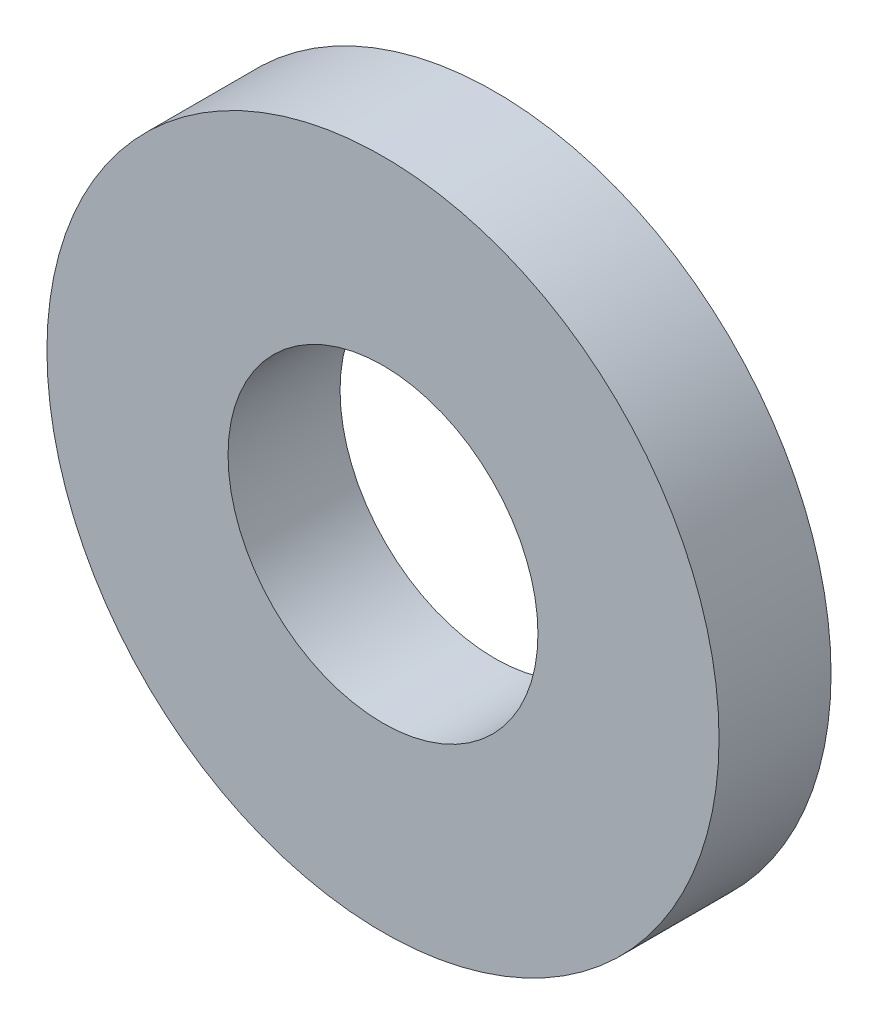
ISO-10303-21;
HEADER;
FILE_DESCRIPTION(('STEP AP214'),'2;1');
FILE_NAME('part.step','',(''),(''),'','','');
FILE_SCHEMA(('AUTOMOTIVE_DESIGN { 1 0 10303 214 1 1 1 1 }'));
ENDSEC;
DATA;
#1=APPLICATION_CONTEXT('core data for automotive mechanical design processes');
#2=APPLICATION_PROTOCOL_DEFINITION('international standard','automotive_design',2000,#1);
#3=PRODUCT_CONTEXT('',#1,'mechanical');
#4=PRODUCT('Part','Part','',(#3));
#5=PRODUCT_RELATED_PRODUCT_CATEGORY('part','',(#4));
#6=PRODUCT_DEFINITION_FORMATION('','',#4);
#7=PRODUCT_DEFINITION_CONTEXT('part definition',#1,'design');
#8=PRODUCT_DEFINITION('design','',#6,#7);
#9=PRODUCT_DEFINITION_SHAPE('','',#8);
#10=(LENGTH_UNIT() NAMED_UNIT(*) SI_UNIT(.MILLI.,.METRE.));
#11=(NAMED_UNIT(*) PLANE_ANGLE_UNIT() SI_UNIT($,.RADIAN.));
#12=(NAMED_UNIT(*) SI_UNIT($,.STERADIAN.) SOLID_ANGLE_UNIT());
#13=UNCERTAINTY_MEASURE_WITH_UNIT(LENGTH_MEASURE(1.E-05),#10,'distance_accuracy_value','');
#14=(GEOMETRIC_REPRESENTATION_CONTEXT(3) GLOBAL_UNCERTAINTY_ASSIGNED_CONTEXT((#13)) GLOBAL_UNIT_ASSIGNED_CONTEXT((#10,
#11,#12)) REPRESENTATION_CONTEXT('',''));
#15=CARTESIAN_POINT('',(0.,0.,0.));
#16=DIRECTION('',(0.,0.,1.));
#17=DIRECTION('',(1.,0.,0.));
#18=AXIS2_PLACEMENT_3D('',#15,#16,#17);
#19=CARTESIAN_POINT('',(0.,0.,3.));
#20=DIRECTION('',(0.,0.,-1.));
#21=DIRECTION('',(-1.,0.,0.));
#22=AXIS2_PLACEMENT_3D('',#19,#20,#21);
#23=CYLINDRICAL_SURFACE('',#22,9.);
#24=CARTESIAN_POINT('',(0.,0.,3.));
#25=DIRECTION('',(0.,0.,1.));
#26=DIRECTION('',(1.,0.,0.));
#27=AXIS2_PLACEMENT_3D('',#24,#25,#26);
#28=CIRCLE('',#27,9.);
#29=CARTESIAN_POINT('',(9.,0.,3.));
#30=VERTEX_POINT('',#29);
#31=EDGE_CURVE('E10',#30,#30,#28,.T.);
#32=ORIENTED_EDGE('',*,*,#31,.F.);
#33=EDGE_LOOP('',(#32));
#34=FACE_BOUND('',#33,.T.);
#35=CARTESIAN_POINT('',(0.,0.,0.));
#36=DIRECTION('',(0.,0.,1.));
#37=DIRECTION('',(1.,0.,0.));
#38=AXIS2_PLACEMENT_3D('',#35,#36,#37);
#39=CIRCLE('',#38,9.);
#40=CARTESIAN_POINT('',(9.,0.,0.));
#41=VERTEX_POINT('',#40);
#42=EDGE_CURVE('E36',#41,#41,#39,.T.);
#43=ORIENTED_EDGE('',*,*,#42,.T.);
#44=EDGE_LOOP('',(#43));
#45=FACE_BOUND('',#44,.T.);
#46=ADVANCED_FACE('F33',(#34,#45),#23,.T.);
#47=CARTESIAN_POINT('',(0.,0.,3.));
#48=DIRECTION('',(0.,0.,1.));
#49=DIRECTION('',(1.,0.,0.));
#50=AXIS2_PLACEMENT_3D('',#47,#48,#49);
#51=PLANE('',#50);
#52=CARTESIAN_POINT('',(0.,0.,3.));
#53=DIRECTION('',(0.,0.,1.));
#54=DIRECTION('',(1.,0.,0.));
#55=AXIS2_PLACEMENT_3D('',#52,#53,#54);
#56=CIRCLE('',#55,4.15);
#57=CARTESIAN_POINT('',(4.15,0.,3.));
#58=VERTEX_POINT('',#57);
#59=EDGE_CURVE('E45',#58,#58,#56,.T.);
#60=ORIENTED_EDGE('',*,*,#59,.F.);
#61=EDGE_LOOP('',(#60));
#62=FACE_BOUND('',#61,.T.);
#63=ORIENTED_EDGE('',*,*,#31,.T.);
#64=EDGE_LOOP('',(#63));
#65=FACE_BOUND('',#64,.T.);
#66=ADVANCED_FACE('F60',(#62,#65),#51,.T.);
#67=CARTESIAN_POINT('',(0.,0.,0.));
#68=DIRECTION('',(0.,0.,1.));
#69=DIRECTION('',(1.,0.,0.));
#70=AXIS2_PLACEMENT_3D('',#67,#68,#69);
#71=PLANE('',#70);
#72=CARTESIAN_POINT('',(0.,0.,0.));
#73=DIRECTION('',(0.,0.,1.));
#74=DIRECTION('',(1.,0.,0.));
#75=AXIS2_PLACEMENT_3D('',#72,#73,#74);
#76=CIRCLE('',#75,4.15);
#77=CARTESIAN_POINT('',(4.15,0.,0.));
#78=VERTEX_POINT('',#77);
#79=EDGE_CURVE('E43',#78,#78,#76,.T.);
#80=ORIENTED_EDGE('',*,*,#79,.T.);
#81=EDGE_LOOP('',(#80));
#82=FACE_BOUND('',#81,.T.);
#83=ORIENTED_EDGE('',*,*,#42,.F.);
#84=EDGE_LOOP('',(#83));
#85=FACE_BOUND('',#84,.T.);
#86=ADVANCED_FACE('F51',(#82,#85),#71,.F.);
#87=CARTESIAN_POINT('',(0.,0.,0.));
#88=DIRECTION('',(0.,0.,1.));
#89=DIRECTION('',(1.,0.,0.));
#90=AXIS2_PLACEMENT_3D('',#87,#88,#89);
#91=CYLINDRICAL_SURFACE('',#90,4.15);
#92=ORIENTED_EDGE('',*,*,#79,.F.);
#93=EDGE_LOOP('',(#92));
#94=FACE_BOUND('',#93,.T.);
#95=ORIENTED_EDGE('',*,*,#59,.T.);
#96=EDGE_LOOP('',(#95));
#97=FACE_BOUND('',#96,.T.);
#98=ADVANCED_FACE('F54',(#94,#97),#91,.F.);
#99=CLOSED_SHELL('',(#46,#66,#86,#98));
#100=MANIFOLD_SOLID_BREP('B2',#99);
#101=ADVANCED_BREP_SHAPE_REPRESENTATION('',(#18,#100),#14);
#102=SHAPE_DEFINITION_REPRESENTATION(#9,#101);
ENDSEC;
END-ISO-10303-21;
